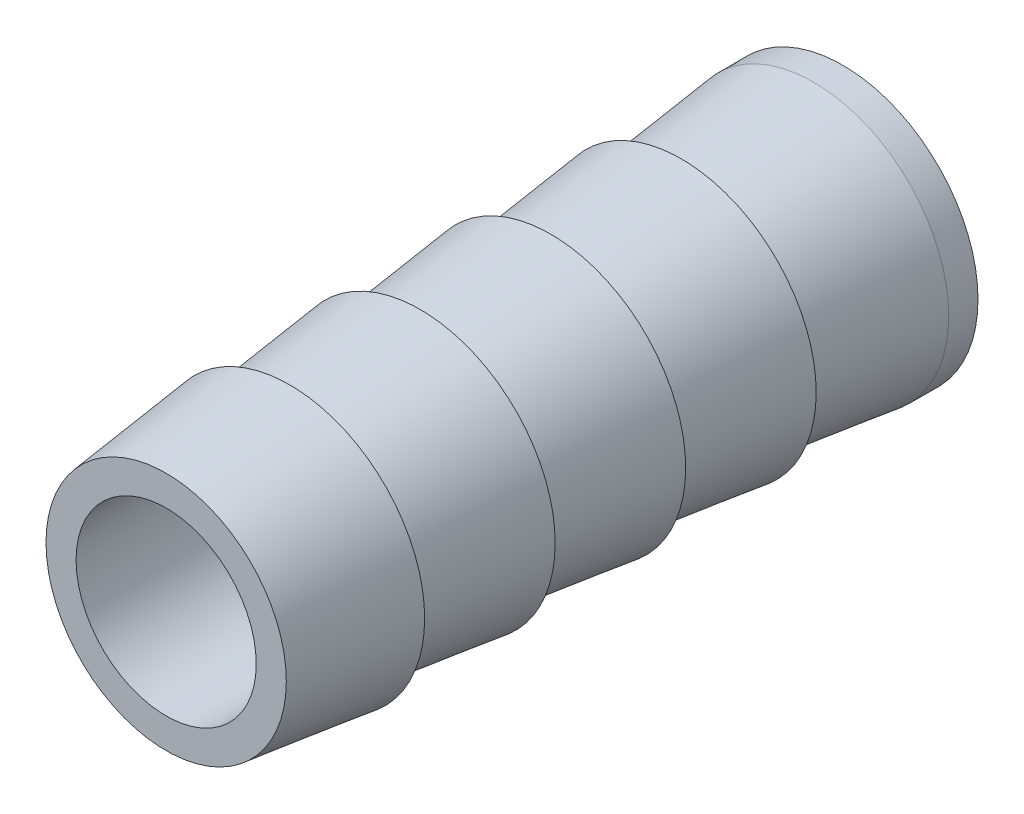
ISO-10303-21;
HEADER;
FILE_DESCRIPTION(('STEP AP214'),'2;1');
FILE_NAME('part.step','',(''),(''),'','','');
FILE_SCHEMA(('AUTOMOTIVE_DESIGN { 1 0 10303 214 1 1 1 1 }'));
ENDSEC;
DATA;
#1=APPLICATION_CONTEXT('core data for automotive mechanical design processes');
#2=APPLICATION_PROTOCOL_DEFINITION('international standard','automotive_design',2000,#1);
#3=PRODUCT_CONTEXT('',#1,'mechanical');
#4=PRODUCT('Part','Part','',(#3));
#5=PRODUCT_RELATED_PRODUCT_CATEGORY('part','',(#4));
#6=PRODUCT_DEFINITION_FORMATION('','',#4);
#7=PRODUCT_DEFINITION_CONTEXT('part definition',#1,'design');
#8=PRODUCT_DEFINITION('design','',#6,#7);
#9=PRODUCT_DEFINITION_SHAPE('','',#8);
#10=(LENGTH_UNIT() NAMED_UNIT(*) SI_UNIT(.MILLI.,.METRE.));
#11=(NAMED_UNIT(*) PLANE_ANGLE_UNIT() SI_UNIT($,.RADIAN.));
#12=(NAMED_UNIT(*) SI_UNIT($,.STERADIAN.) SOLID_ANGLE_UNIT());
#13=UNCERTAINTY_MEASURE_WITH_UNIT(LENGTH_MEASURE(1.E-05),#10,'distance_accuracy_value','');
#14=(GEOMETRIC_REPRESENTATION_CONTEXT(3) GLOBAL_UNCERTAINTY_ASSIGNED_CONTEXT((#13)) GLOBAL_UNIT_ASSIGNED_CONTEXT((#10,
#11,#12)) REPRESENTATION_CONTEXT('',''));
#15=CARTESIAN_POINT('',(0.,0.,0.));
#16=DIRECTION('',(0.,0.,1.));
#17=DIRECTION('',(1.,0.,0.));
#18=AXIS2_PLACEMENT_3D('',#15,#16,#17);
#19=CARTESIAN_POINT('',(0.,0.,15.1117108872177));
#20=DIRECTION('',(0.,0.,-1.));
#21=DIRECTION('',(-1.,0.,0.));
#22=AXIS2_PLACEMENT_3D('',#19,#20,#21);
#23=PLANE('',#22);
#24=CARTESIAN_POINT('',(0.,0.,15.1117108872177));
#25=DIRECTION('',(0.,0.,1.));
#26=DIRECTION('',(1.,0.,0.));
#27=AXIS2_PLACEMENT_3D('',#24,#25,#26);
#28=CIRCLE('',#27,3.175);
#29=CARTESIAN_POINT('',(3.175,0.,15.1117108872177));
#30=VERTEX_POINT('',#29);
#31=EDGE_CURVE('E95',#30,#30,#28,.T.);
#32=ORIENTED_EDGE('',*,*,#31,.F.);
#33=EDGE_LOOP('',(#32));
#34=FACE_BOUND('',#33,.T.);
#35=CARTESIAN_POINT('',(0.,0.,15.1117108872177));
#36=DIRECTION('',(0.,0.,1.));
#37=DIRECTION('',(1.,0.,0.));
#38=AXIS2_PLACEMENT_3D('',#35,#36,#37);
#39=CIRCLE('',#38,4.23481316657805);
#40=CARTESIAN_POINT('',(4.23481316657805,0.,15.1117108872177));
#41=VERTEX_POINT('',#40);
#42=EDGE_CURVE('E10',#41,#41,#39,.T.);
#43=ORIENTED_EDGE('',*,*,#42,.T.);
#44=EDGE_LOOP('',(#43));
#45=FACE_BOUND('',#44,.T.);
#46=ADVANCED_FACE('F43',(#34,#45),#23,.F.);
#47=CARTESIAN_POINT('',(0.,0.,10.7544644355262));
#48=DIRECTION('',(0.,0.,-1.));
#49=DIRECTION('',(-1.,0.,0.));
#50=AXIS2_PLACEMENT_3D('',#47,#48,#49);
#51=CONICAL_SURFACE('',#50,4.75362249387178,0.118510215194434);
#52=ORIENTED_EDGE('',*,*,#42,.F.);
#53=EDGE_LOOP('',(#52));
#54=FACE_BOUND('',#53,.T.);
#55=CARTESIAN_POINT('',(0.,0.,10.7544644355262));
#56=DIRECTION('',(0.,0.,1.));
#57=DIRECTION('',(1.,0.,0.));
#58=AXIS2_PLACEMENT_3D('',#55,#56,#57);
#59=CIRCLE('',#58,4.75362249387178);
#60=CARTESIAN_POINT('',(4.75362249387178,0.,10.7544644355262));
#61=VERTEX_POINT('',#60);
#62=EDGE_CURVE('E50',#61,#61,#59,.T.);
#63=ORIENTED_EDGE('',*,*,#62,.T.);
#64=EDGE_LOOP('',(#63));
#65=FACE_BOUND('',#64,.T.);
#66=ADVANCED_FACE('F113',(#54,#65),#51,.T.);
#67=CARTESIAN_POINT('',(0.,4.75362249387178,10.7544644355262));
#68=DIRECTION('',(0.,0.,1.));
#69=DIRECTION('',(1.,0.,0.));
#70=AXIS2_PLACEMENT_3D('',#67,#68,#69);
#71=PLANE('',#70);
#72=ORIENTED_EDGE('',*,*,#62,.F.);
#73=EDGE_LOOP('',(#72));
#74=FACE_BOUND('',#73,.T.);
#75=CARTESIAN_POINT('',(0.,0.,10.7544644355262));
#76=DIRECTION('',(0.,0.,1.));
#77=DIRECTION('',(1.,0.,0.));
#78=AXIS2_PLACEMENT_3D('',#75,#76,#77);
#79=CIRCLE('',#78,4.20593499387177);
#80=CARTESIAN_POINT('',(4.20593499387177,0.,10.7544644355262));
#81=VERTEX_POINT('',#80);
#82=EDGE_CURVE('E55',#81,#81,#79,.T.);
#83=ORIENTED_EDGE('',*,*,#82,.T.);
#84=EDGE_LOOP('',(#83));
#85=FACE_BOUND('',#84,.T.);
#86=ADVANCED_FACE('F119',(#74,#85),#71,.F.);
#87=CARTESIAN_POINT('',(0.,0.,6.15468318552619));
#88=DIRECTION('',(0.,0.,-1.));
#89=DIRECTION('',(-1.,0.,0.));
#90=AXIS2_PLACEMENT_3D('',#87,#88,#89);
#91=CONICAL_SURFACE('',#90,4.75362249387177,0.118510215194434);
#92=ORIENTED_EDGE('',*,*,#82,.F.);
#93=EDGE_LOOP('',(#92));
#94=FACE_BOUND('',#93,.T.);
#95=CARTESIAN_POINT('',(0.,0.,6.15468318552619));
#96=DIRECTION('',(0.,0.,1.));
#97=DIRECTION('',(1.,0.,0.));
#98=AXIS2_PLACEMENT_3D('',#95,#96,#97);
#99=CIRCLE('',#98,4.75362249387177);
#100=CARTESIAN_POINT('',(4.75362249387177,0.,6.15468318552619));
#101=VERTEX_POINT('',#100);
#102=EDGE_CURVE('E60',#101,#101,#99,.T.);
#103=ORIENTED_EDGE('',*,*,#102,.T.);
#104=EDGE_LOOP('',(#103));
#105=FACE_BOUND('',#104,.T.);
#106=ADVANCED_FACE('F124',(#94,#105),#91,.T.);
#107=CARTESIAN_POINT('',(0.,4.75362249387177,6.15468318552619));
#108=DIRECTION('',(0.,0.,1.));
#109=DIRECTION('',(1.,0.,0.));
#110=AXIS2_PLACEMENT_3D('',#107,#108,#109);
#111=PLANE('',#110);
#112=ORIENTED_EDGE('',*,*,#102,.F.);
#113=EDGE_LOOP('',(#112));
#114=FACE_BOUND('',#113,.T.);
#115=CARTESIAN_POINT('',(0.,0.,6.15468318552619));
#116=DIRECTION('',(0.,0.,1.));
#117=DIRECTION('',(1.,0.,0.));
#118=AXIS2_PLACEMENT_3D('',#115,#116,#117);
#119=CIRCLE('',#118,4.20593499387177);
#120=CARTESIAN_POINT('',(4.20593499387177,0.,6.15468318552619));
#121=VERTEX_POINT('',#120);
#122=EDGE_CURVE('E66',#121,#121,#119,.T.);
#123=ORIENTED_EDGE('',*,*,#122,.T.);
#124=EDGE_LOOP('',(#123));
#125=FACE_BOUND('',#124,.T.);
#126=ADVANCED_FACE('F130',(#114,#125),#111,.F.);
#127=CARTESIAN_POINT('',(0.,0.,1.55490193552618));
#128=DIRECTION('',(0.,0.,-1.));
#129=DIRECTION('',(-1.,0.,0.));
#130=AXIS2_PLACEMENT_3D('',#127,#128,#129);
#131=CONICAL_SURFACE('',#130,4.75362249387178,0.118510215194434);
#132=ORIENTED_EDGE('',*,*,#122,.F.);
#133=EDGE_LOOP('',(#132));
#134=FACE_BOUND('',#133,.T.);
#135=CARTESIAN_POINT('',(0.,0.,1.55490193552618));
#136=DIRECTION('',(0.,0.,1.));
#137=DIRECTION('',(1.,0.,0.));
#138=AXIS2_PLACEMENT_3D('',#135,#136,#137);
#139=CIRCLE('',#138,4.75362249387178);
#140=CARTESIAN_POINT('',(4.75362249387178,0.,1.55490193552618));
#141=VERTEX_POINT('',#140);
#142=EDGE_CURVE('E70',#141,#141,#139,.T.);
#143=ORIENTED_EDGE('',*,*,#142,.T.);
#144=EDGE_LOOP('',(#143));
#145=FACE_BOUND('',#144,.T.);
#146=ADVANCED_FACE('F134',(#134,#145),#131,.T.);
#147=CARTESIAN_POINT('',(0.,4.75362249387178,1.55490193552618));
#148=DIRECTION('',(0.,0.,1.));
#149=DIRECTION('',(1.,0.,0.));
#150=AXIS2_PLACEMENT_3D('',#147,#148,#149);
#151=PLANE('',#150);
#152=ORIENTED_EDGE('',*,*,#142,.F.);
#153=EDGE_LOOP('',(#152));
#154=FACE_BOUND('',#153,.T.);
#155=CARTESIAN_POINT('',(0.,0.,1.55490193552618));
#156=DIRECTION('',(0.,0.,1.));
#157=DIRECTION('',(1.,0.,0.));
#158=AXIS2_PLACEMENT_3D('',#155,#156,#157);
#159=CIRCLE('',#158,4.20593499387178);
#160=CARTESIAN_POINT('',(4.20593499387178,0.,1.55490193552618));
#161=VERTEX_POINT('',#160);
#162=EDGE_CURVE('E74',#161,#161,#159,.T.);
#163=ORIENTED_EDGE('',*,*,#162,.T.);
#164=EDGE_LOOP('',(#163));
#165=FACE_BOUND('',#164,.T.);
#166=ADVANCED_FACE('F138',(#154,#165),#151,.F.);
#167=CARTESIAN_POINT('',(0.,0.,-3.04487931447382));
#168=DIRECTION('',(0.,0.,-1.));
#169=DIRECTION('',(-1.,0.,0.));
#170=AXIS2_PLACEMENT_3D('',#167,#168,#169);
#171=CONICAL_SURFACE('',#170,4.75362249387177,0.118510215194434);
#172=ORIENTED_EDGE('',*,*,#162,.F.);
#173=EDGE_LOOP('',(#172));
#174=FACE_BOUND('',#173,.T.);
#175=CARTESIAN_POINT('',(0.,0.,-3.04487931447382));
#176=DIRECTION('',(0.,0.,1.));
#177=DIRECTION('',(1.,0.,0.));
#178=AXIS2_PLACEMENT_3D('',#175,#176,#177);
#179=CIRCLE('',#178,4.75362249387177);
#180=CARTESIAN_POINT('',(4.75362249387177,0.,-3.04487931447382));
#181=VERTEX_POINT('',#180);
#182=EDGE_CURVE('E78',#181,#181,#179,.T.);
#183=ORIENTED_EDGE('',*,*,#182,.T.);
#184=EDGE_LOOP('',(#183));
#185=FACE_BOUND('',#184,.T.);
#186=ADVANCED_FACE('F142',(#174,#185),#171,.T.);
#187=CARTESIAN_POINT('',(0.,4.75362249387177,-3.04487931447382));
#188=DIRECTION('',(0.,0.,1.));
#189=DIRECTION('',(1.,0.,0.));
#190=AXIS2_PLACEMENT_3D('',#187,#188,#189);
#191=PLANE('',#190);
#192=ORIENTED_EDGE('',*,*,#182,.F.);
#193=EDGE_LOOP('',(#192));
#194=FACE_BOUND('',#193,.T.);
#195=CARTESIAN_POINT('',(0.,0.,-3.04487931447382));
#196=DIRECTION('',(0.,0.,1.));
#197=DIRECTION('',(1.,0.,0.));
#198=AXIS2_PLACEMENT_3D('',#195,#196,#197);
#199=CIRCLE('',#198,4.20593499387178);
#200=CARTESIAN_POINT('',(4.20593499387178,0.,-3.04487931447382));
#201=VERTEX_POINT('',#200);
#202=EDGE_CURVE('E82',#201,#201,#199,.T.);
#203=ORIENTED_EDGE('',*,*,#202,.T.);
#204=EDGE_LOOP('',(#203));
#205=FACE_BOUND('',#204,.T.);
#206=ADVANCED_FACE('F146',(#194,#205),#191,.F.);
#207=CARTESIAN_POINT('',(0.,0.,-7.70799669082972));
#208=DIRECTION('',(0.,0.,-1.));
#209=DIRECTION('',(-1.,0.,0.));
#210=AXIS2_PLACEMENT_3D('',#207,#208,#209);
#211=CONICAL_SURFACE('',#210,4.7611638100384,0.118510215194434);
#212=ORIENTED_EDGE('',*,*,#202,.F.);
#213=EDGE_LOOP('',(#212));
#214=FACE_BOUND('',#213,.T.);
#215=CARTESIAN_POINT('',(0.,0.,-7.70799669082972));
#216=DIRECTION('',(0.,0.,1.));
#217=DIRECTION('',(1.,0.,0.));
#218=AXIS2_PLACEMENT_3D('',#215,#216,#217);
#219=CIRCLE('',#218,4.7611638100384);
#220=CARTESIAN_POINT('',(4.7611638100384,0.,-7.70799669082972));
#221=VERTEX_POINT('',#220);
#222=EDGE_CURVE('E86',#221,#221,#219,.T.);
#223=ORIENTED_EDGE('',*,*,#222,.T.);
#224=EDGE_LOOP('',(#223));
#225=FACE_BOUND('',#224,.T.);
#226=ADVANCED_FACE('F150',(#214,#225),#211,.T.);
#227=CARTESIAN_POINT('',(0.,0.,-8.7391875));
#228=DIRECTION('',(0.,0.,-1.));
#229=DIRECTION('',(-1.,0.,0.));
#230=AXIS2_PLACEMENT_3D('',#227,#228,#229);
#231=CONICAL_SURFACE('',#230,4.7625,0.00129577300523624);
#232=ORIENTED_EDGE('',*,*,#222,.F.);
#233=EDGE_LOOP('',(#232));
#234=FACE_BOUND('',#233,.T.);
#235=CARTESIAN_POINT('',(0.,0.,-8.7391875));
#236=DIRECTION('',(0.,0.,1.));
#237=DIRECTION('',(1.,0.,0.));
#238=AXIS2_PLACEMENT_3D('',#235,#236,#237);
#239=CIRCLE('',#238,4.7625);
#240=CARTESIAN_POINT('',(4.7625,0.,-8.7391875));
#241=VERTEX_POINT('',#240);
#242=EDGE_CURVE('E90',#241,#241,#239,.T.);
#243=ORIENTED_EDGE('',*,*,#242,.T.);
#244=EDGE_LOOP('',(#243));
#245=FACE_BOUND('',#244,.T.);
#246=ADVANCED_FACE('F154',(#234,#245),#231,.T.);
#247=CARTESIAN_POINT('',(0.,4.7625,-8.7391875));
#248=DIRECTION('',(0.,0.,1.));
#249=DIRECTION('',(1.,0.,0.));
#250=AXIS2_PLACEMENT_3D('',#247,#248,#249);
#251=PLANE('',#250);
#252=CARTESIAN_POINT('',(0.,0.,-8.7391875));
#253=DIRECTION('',(0.,0.,1.));
#254=DIRECTION('',(1.,0.,0.));
#255=AXIS2_PLACEMENT_3D('',#252,#253,#254);
#256=CIRCLE('',#255,3.175);
#257=CARTESIAN_POINT('',(3.175,0.,-8.7391875));
#258=VERTEX_POINT('',#257);
#259=EDGE_CURVE('E94',#258,#258,#256,.T.);
#260=ORIENTED_EDGE('',*,*,#259,.T.);
#261=EDGE_LOOP('',(#260));
#262=FACE_BOUND('',#261,.T.);
#263=ORIENTED_EDGE('',*,*,#242,.F.);
#264=EDGE_LOOP('',(#263));
#265=FACE_BOUND('',#264,.T.);
#266=ADVANCED_FACE('F103',(#262,#265),#251,.F.);
#267=CARTESIAN_POINT('',(0.,0.,-8.7391875));
#268=DIRECTION('',(0.,0.,1.));
#269=DIRECTION('',(1.,0.,0.));
#270=AXIS2_PLACEMENT_3D('',#267,#268,#269);
#271=CYLINDRICAL_SURFACE('',#270,3.175);
#272=ORIENTED_EDGE('',*,*,#259,.F.);
#273=EDGE_LOOP('',(#272));
#274=FACE_BOUND('',#273,.T.);
#275=ORIENTED_EDGE('',*,*,#31,.T.);
#276=EDGE_LOOP('',(#275));
#277=FACE_BOUND('',#276,.T.);
#278=ADVANCED_FACE('F106',(#274,#277),#271,.F.);
#279=CLOSED_SHELL('',(#46,#66,#86,#106,#126,#146,#166,#186,#206,#226,#246,#266,#278));
#280=MANIFOLD_SOLID_BREP('B2',#279);
#281=ADVANCED_BREP_SHAPE_REPRESENTATION('',(#18,#280),#14);
#282=SHAPE_DEFINITION_REPRESENTATION(#9,#281);
ENDSEC;
END-ISO-10303-21;
